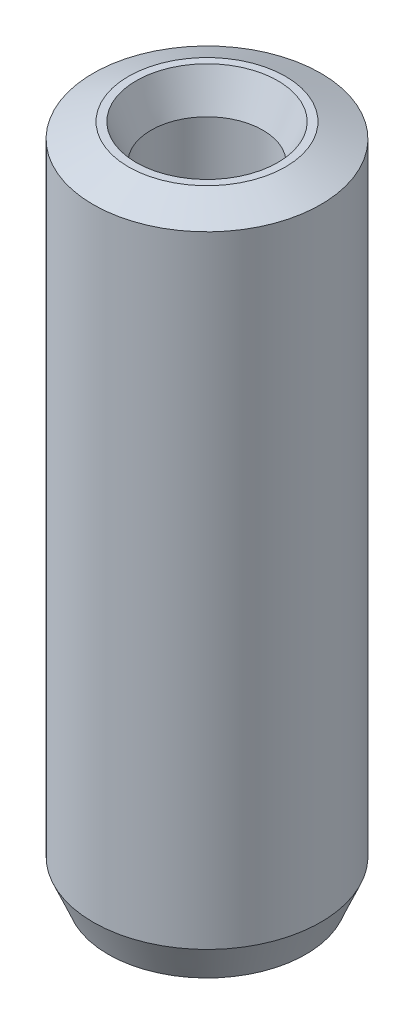
ISO-10303-21;
HEADER;
FILE_DESCRIPTION(('STEP AP214'),'2;1');
FILE_NAME('part.step','',(''),(''),'','','');
FILE_SCHEMA(('AUTOMOTIVE_DESIGN { 1 0 10303 214 1 1 1 1 }'));
ENDSEC;
DATA;
#1=APPLICATION_CONTEXT('core data for automotive mechanical design processes');
#2=APPLICATION_PROTOCOL_DEFINITION('international standard','automotive_design',2000,#1);
#3=PRODUCT_CONTEXT('',#1,'mechanical');
#4=PRODUCT('Part','Part','',(#3));
#5=PRODUCT_RELATED_PRODUCT_CATEGORY('part','',(#4));
#6=PRODUCT_DEFINITION_FORMATION('','',#4);
#7=PRODUCT_DEFINITION_CONTEXT('part definition',#1,'design');
#8=PRODUCT_DEFINITION('design','',#6,#7);
#9=PRODUCT_DEFINITION_SHAPE('','',#8);
#10=(LENGTH_UNIT() NAMED_UNIT(*) SI_UNIT(.MILLI.,.METRE.));
#11=(NAMED_UNIT(*) PLANE_ANGLE_UNIT() SI_UNIT($,.RADIAN.));
#12=(NAMED_UNIT(*) SI_UNIT($,.STERADIAN.) SOLID_ANGLE_UNIT());
#13=UNCERTAINTY_MEASURE_WITH_UNIT(LENGTH_MEASURE(1.E-05),#10,'distance_accuracy_value','');
#14=(GEOMETRIC_REPRESENTATION_CONTEXT(3) GLOBAL_UNCERTAINTY_ASSIGNED_CONTEXT((#13)) GLOBAL_UNIT_ASSIGNED_CONTEXT((#10,
#11,#12)) REPRESENTATION_CONTEXT('',''));
#15=CARTESIAN_POINT('',(0.,0.,0.));
#16=DIRECTION('',(0.,0.,1.));
#17=DIRECTION('',(1.,0.,0.));
#18=AXIS2_PLACEMENT_3D('',#15,#16,#17);
#19=CARTESIAN_POINT('',(0.,29.5099725010474,0.));
#20=DIRECTION('',(0.,-1.,0.));
#21=DIRECTION('',(0.,0.,-1.));
#22=AXIS2_PLACEMENT_3D('',#19,#20,#21);
#23=CYLINDRICAL_SURFACE('',#22,5.);
#24=CARTESIAN_POINT('',(0.,1.55133346219069,0.));
#25=DIRECTION('',(0.,1.,0.));
#26=DIRECTION('',(0.,0.,1.));
#27=AXIS2_PLACEMENT_3D('',#24,#25,#26);
#28=CIRCLE('',#27,5.);
#29=CARTESIAN_POINT('',(0.,1.55133346219069,-5.));
#30=VERTEX_POINT('',#29);
#31=EDGE_CURVE('E10',#30,#30,#28,.T.);
#32=CARTESIAN_POINT('',(0.,28.8526607672738,0.));
#33=DIRECTION('',(0.,1.,0.));
#34=DIRECTION('',(0.,0.,1.));
#35=AXIS2_PLACEMENT_3D('',#32,#33,#34);
#36=CIRCLE('',#35,5.);
#37=CARTESIAN_POINT('',(0.,28.8526607672738,-5.));
#38=VERTEX_POINT('',#37);
#39=EDGE_CURVE('E50',#38,#38,#36,.F.);
#40=CARTESIAN_POINT('',(0.,1.55133346219069,-5.));
#41=CARTESIAN_POINT('',(0.,1.8357222882853,-5.));
#42=CARTESIAN_POINT('',(0.,2.12011111437992,-5.));
#43=CARTESIAN_POINT('',(0.,2.68888876656915,-5.));
#44=CARTESIAN_POINT('',(0.,2.97327759266377,-5.));
#45=CARTESIAN_POINT('',(0.,3.542055244853,-5.));
#46=CARTESIAN_POINT('',(0.,3.82644407094761,-5.));
#47=CARTESIAN_POINT('',(0.,4.39522172313684,-5.));
#48=CARTESIAN_POINT('',(0.,4.67961054923146,-5.));
#49=CARTESIAN_POINT('',(0.,5.24838820142069,-5.));
#50=CARTESIAN_POINT('',(0.,5.53277702751531,-5.));
#51=CARTESIAN_POINT('',(0.,6.10155467970454,-5.));
#52=CARTESIAN_POINT('',(0.,6.38594350579915,-5.));
#53=CARTESIAN_POINT('',(0.,6.95472115798838,-5.));
#54=CARTESIAN_POINT('',(0.,7.239109984083,-5.));
#55=CARTESIAN_POINT('',(0.,7.80788763627223,-5.));
#56=CARTESIAN_POINT('',(0.,8.09227646236685,-5.));
#57=CARTESIAN_POINT('',(0.,8.66105411455608,-5.));
#58=CARTESIAN_POINT('',(0.,8.94544294065069,-5.));
#59=CARTESIAN_POINT('',(0.,9.51422059283992,-5.));
#60=CARTESIAN_POINT('',(0.,9.79860941893454,-5.));
#61=CARTESIAN_POINT('',(0.,10.3673870711238,-5.));
#62=CARTESIAN_POINT('',(0.,10.6517758972184,-5.));
#63=CARTESIAN_POINT('',(0.,11.2205535494076,-5.));
#64=CARTESIAN_POINT('',(0.,11.5049423755022,-5.));
#65=CARTESIAN_POINT('',(0.,12.0737200276915,-5.));
#66=CARTESIAN_POINT('',(0.,12.3581088537861,-5.));
#67=CARTESIAN_POINT('',(0.,12.9268865059753,-5.));
#68=CARTESIAN_POINT('',(0.,13.2112753320699,-5.));
#69=CARTESIAN_POINT('',(0.,13.7800529842592,-5.));
#70=CARTESIAN_POINT('',(0.,14.0644418103538,-5.));
#71=CARTESIAN_POINT('',(0.,14.633219462543,-5.));
#72=CARTESIAN_POINT('',(0.,14.9176082886376,-5.));
#73=CARTESIAN_POINT('',(0.,15.4863859408269,-5.));
#74=CARTESIAN_POINT('',(0.,15.7707747669215,-5.));
#75=CARTESIAN_POINT('',(0.,16.3395524191107,-5.));
#76=CARTESIAN_POINT('',(0.,16.6239412452053,-5.));
#77=CARTESIAN_POINT('',(0.,17.1927188973945,-5.));
#78=CARTESIAN_POINT('',(0.,17.4771077234892,-5.));
#79=CARTESIAN_POINT('',(0.,18.0458853756784,-5.));
#80=CARTESIAN_POINT('',(0.,18.330274201773,-5.));
#81=CARTESIAN_POINT('',(0.,18.8990518539622,-5.));
#82=CARTESIAN_POINT('',(0.,19.1834406800569,-5.));
#83=CARTESIAN_POINT('',(0.,19.7522183322461,-5.));
#84=CARTESIAN_POINT('',(0.,20.0366071583407,-5.));
#85=CARTESIAN_POINT('',(0.,20.6053848105299,-5.));
#86=CARTESIAN_POINT('',(0.,20.8897736366246,-5.));
#87=CARTESIAN_POINT('',(0.,21.4585512888138,-5.));
#88=CARTESIAN_POINT('',(0.,21.7429401149084,-5.));
#89=CARTESIAN_POINT('',(0.,22.3117177670976,-5.));
#90=CARTESIAN_POINT('',(0.,22.5961065931922,-5.));
#91=CARTESIAN_POINT('',(0.,23.1648842453815,-5.));
#92=CARTESIAN_POINT('',(0.,23.4492730714761,-5.));
#93=CARTESIAN_POINT('',(0.,24.0180507236653,-5.));
#94=CARTESIAN_POINT('',(0.,24.3024395497599,-5.));
#95=CARTESIAN_POINT('',(0.,24.8712172019492,-5.));
#96=CARTESIAN_POINT('',(0.,25.1556060280438,-5.));
#97=CARTESIAN_POINT('',(0.,25.724383680233,-5.));
#98=CARTESIAN_POINT('',(0.,26.0087725063276,-5.));
#99=CARTESIAN_POINT('',(0.,26.5775501585169,-5.));
#100=CARTESIAN_POINT('',(0.,26.8619389846115,-5.));
#101=CARTESIAN_POINT('',(0.,27.4307166368007,-5.));
#102=CARTESIAN_POINT('',(0.,27.7151054628953,-5.));
#103=CARTESIAN_POINT('',(0.,28.2838831150846,-5.));
#104=CARTESIAN_POINT('',(0.,28.5682719411792,-5.));
#105=CARTESIAN_POINT('',(0.,28.8526607672738,-5.));
#106=B_SPLINE_CURVE_WITH_KNOTS('',3,(#40,#41,#42,#43,#44,#45,#46,#47,#48,#49,#50,#51,#52,#53,
#54,#55,#56,#57,#58,#59,#60,#61,#62,#63,#64,#65,#66,#67,#68,#69,#70,#71,#72,#73,#74,#75,#76,#77,
#78,#79,#80,#81,#82,#83,#84,#85,#86,#87,#88,#89,#90,#91,#92,#93,#94,#95,#96,#97,#98,#99,#100,
#101,#102,#103,#104,#105),.UNSPECIFIED.,.F.,.F.,(4,2,2,2,2,2,2,2,2,2,2,2,2,2,2,2,2,2,2,2,2,2,2,
2,2,2,2,2,2,2,2,2,4),(0.,0.853166478283846,1.70633295656769,2.55949943485154,3.41266591313539,
4.26583239141923,5.11899886970308,5.97216534798693,6.82533182627077,7.67849830455462,
8.53166478283847,9.38483126112232,10.2379977394062,11.09116421769,11.9443306959739,
12.7974971742577,13.6506636525415,14.5038301308254,15.3569966091092,16.2101630873931,
17.0633295656769,17.9164960439608,18.7696625222446,19.6228290005285,20.4759954788123,
21.3291619570962,22.18232843538,23.0354949136639,23.8886613919477,24.7418278702316,
25.5949943485154,26.4481608267992,27.3013273050831),.UNSPECIFIED.);
#107=EDGE_CURVE('BSEAM39',#30,#38,#106,.T.);
#108=ORIENTED_EDGE('',*,*,#31,.T.);
#109=ORIENTED_EDGE('',*,*,#39,.T.);
#110=ORIENTED_EDGE('',*,*,#107,.T.);
#111=ORIENTED_EDGE('',*,*,#107,.F.);
#112=EDGE_LOOP('',(#108,#110,#109,#111));
#113=FACE_BOUND('',#112,.T.);
#114=ADVANCED_FACE('F39',(#113),#23,.T.);
#115=CARTESIAN_POINT('',(0.,29.5099725010474,0.));
#116=DIRECTION('',(0.,1.,0.));
#117=DIRECTION('',(0.,0.,1.));
#118=AXIS2_PLACEMENT_3D('',#115,#116,#117);
#119=PLANE('',#118);
#120=CARTESIAN_POINT('',(0.,29.5099725010474,0.));
#121=DIRECTION('',(0.,1.,0.));
#122=DIRECTION('',(0.,0.,1.));
#123=AXIS2_PLACEMENT_3D('',#120,#121,#122);
#124=CIRCLE('',#123,3.11304824204588);
#125=CARTESIAN_POINT('',(0.,29.5099725010474,3.11304824204588));
#126=VERTEX_POINT('',#125);
#127=EDGE_CURVE('E58',#126,#126,#124,.F.);
#128=ORIENTED_EDGE('',*,*,#127,.T.);
#129=EDGE_LOOP('',(#128));
#130=FACE_BOUND('',#129,.T.);
#131=CARTESIAN_POINT('',(0.,29.5099725010474,0.));
#132=DIRECTION('',(0.,1.,0.));
#133=DIRECTION('',(0.,0.,1.));
#134=AXIS2_PLACEMENT_3D('',#131,#132,#133);
#135=CIRCLE('',#134,3.44866653780942);
#136=CARTESIAN_POINT('',(0.,29.5099725010474,3.44866653780942));
#137=VERTEX_POINT('',#136);
#138=EDGE_CURVE('E61',#137,#137,#135,.T.);
#139=ORIENTED_EDGE('',*,*,#138,.T.);
#140=EDGE_LOOP('',(#139));
#141=FACE_BOUND('',#140,.T.);
#142=ADVANCED_FACE('F88',(#130,#141),#119,.T.);
#143=CARTESIAN_POINT('',(0.,0.,0.));
#144=DIRECTION('',(0.,1.,0.));
#145=DIRECTION('',(0.,0.,1.));
#146=AXIS2_PLACEMENT_3D('',#143,#144,#145);
#147=PLANE('',#146);
#148=CARTESIAN_POINT('',(0.,0.,0.));
#149=DIRECTION('',(0.,1.,0.));
#150=DIRECTION('',(0.,0.,1.));
#151=AXIS2_PLACEMENT_3D('',#148,#149,#150);
#152=CIRCLE('',#151,4.00706997046281);
#153=CARTESIAN_POINT('',(0.,0.,4.00706997046281));
#154=VERTEX_POINT('',#153);
#155=EDGE_CURVE('E51',#154,#154,#152,.T.);
#156=ORIENTED_EDGE('',*,*,#155,.T.);
#157=EDGE_LOOP('',(#156));
#158=FACE_BOUND('',#157,.T.);
#159=CARTESIAN_POINT('',(0.,0.,0.));
#160=DIRECTION('',(0.,1.,0.));
#161=DIRECTION('',(0.,0.,1.));
#162=AXIS2_PLACEMENT_3D('',#159,#160,#161);
#163=CIRCLE('',#162,4.34268826622634);
#164=CARTESIAN_POINT('',(0.,0.,4.34268826622634));
#165=VERTEX_POINT('',#164);
#166=EDGE_CURVE('E54',#165,#165,#163,.F.);
#167=ORIENTED_EDGE('',*,*,#166,.T.);
#168=EDGE_LOOP('',(#167));
#169=FACE_BOUND('',#168,.T.);
#170=ADVANCED_FACE('F83',(#158,#169),#147,.F.);
#171=CARTESIAN_POINT('',(0.,29.5099725010474,0.));
#172=DIRECTION('',(0.,-1.,0.));
#173=DIRECTION('',(0.,0.,-1.));
#174=AXIS2_PLACEMENT_3D('',#171,#172,#173);
#175=CYLINDRICAL_SURFACE('',#174,2.45573650827224);
#176=CARTESIAN_POINT('',(0.,27.9586390388567,0.));
#177=DIRECTION('',(0.,1.,0.));
#178=DIRECTION('',(0.,0.,1.));
#179=AXIS2_PLACEMENT_3D('',#176,#177,#178);
#180=CIRCLE('',#179,2.45573650827224);
#181=CARTESIAN_POINT('',(0.,27.9586390388567,-2.45573650827224));
#182=VERTEX_POINT('',#181);
#183=EDGE_CURVE('E67',#182,#182,#180,.T.);
#184=CARTESIAN_POINT('',(0.,0.657311733773609,0.));
#185=DIRECTION('',(0.,1.,0.));
#186=DIRECTION('',(0.,0.,1.));
#187=AXIS2_PLACEMENT_3D('',#184,#185,#186);
#188=CIRCLE('',#187,2.45573650827224);
#189=CARTESIAN_POINT('',(0.,0.657311733773609,-2.45573650827224));
#190=VERTEX_POINT('',#189);
#191=EDGE_CURVE('E69',#190,#190,#188,.F.);
#192=CARTESIAN_POINT('',(0.,27.9586390388567,-2.45573650827224));
#193=CARTESIAN_POINT('',(0.,27.6742502127621,-2.45573650827224));
#194=CARTESIAN_POINT('',(0.,27.3898613866675,-2.45573650827224));
#195=CARTESIAN_POINT('',(0.,26.8210837344783,-2.45573650827224));
#196=CARTESIAN_POINT('',(0.,26.5366949083837,-2.45573650827224));
#197=CARTESIAN_POINT('',(0.,25.9679172561944,-2.45573650827224));
#198=CARTESIAN_POINT('',(0.,25.6835284300998,-2.45573650827224));
#199=CARTESIAN_POINT('',(0.,25.1147507779106,-2.45573650827224));
#200=CARTESIAN_POINT('',(0.,24.830361951816,-2.45573650827224));
#201=CARTESIAN_POINT('',(0.,24.2615842996267,-2.45573650827224));
#202=CARTESIAN_POINT('',(0.,23.9771954735321,-2.45573650827224));
#203=CARTESIAN_POINT('',(0.,23.4084178213429,-2.45573650827224));
#204=CARTESIAN_POINT('',(0.,23.1240289952483,-2.45573650827224));
#205=CARTESIAN_POINT('',(0.,22.555251343059,-2.45573650827224));
#206=CARTESIAN_POINT('',(0.,22.2708625169644,-2.45573650827224));
#207=CARTESIAN_POINT('',(0.,21.7020848647752,-2.45573650827224));
#208=CARTESIAN_POINT('',(0.,21.4176960386806,-2.45573650827224));
#209=CARTESIAN_POINT('',(0.,20.8489183864913,-2.45573650827224));
#210=CARTESIAN_POINT('',(0.,20.5645295603967,-2.45573650827224));
#211=CARTESIAN_POINT('',(0.,19.9957519082075,-2.45573650827224));
#212=CARTESIAN_POINT('',(0.,19.7113630821129,-2.45573650827224));
#213=CARTESIAN_POINT('',(0.,19.1425854299237,-2.45573650827224));
#214=CARTESIAN_POINT('',(0.,18.858196603829,-2.45573650827224));
#215=CARTESIAN_POINT('',(0.,18.2894189516398,-2.45573650827224));
#216=CARTESIAN_POINT('',(0.,18.0050301255452,-2.45573650827224));
#217=CARTESIAN_POINT('',(0.,17.436252473356,-2.45573650827224));
#218=CARTESIAN_POINT('',(0.,17.1518636472613,-2.45573650827224));
#219=CARTESIAN_POINT('',(0.,16.5830859950721,-2.45573650827224));
#220=CARTESIAN_POINT('',(0.,16.2986971689775,-2.45573650827224));
#221=CARTESIAN_POINT('',(0.,15.7299195167883,-2.45573650827224));
#222=CARTESIAN_POINT('',(0.,15.4455306906936,-2.45573650827224));
#223=CARTESIAN_POINT('',(0.,14.8767530385044,-2.45573650827224));
#224=CARTESIAN_POINT('',(0.,14.5923642124098,-2.45573650827224));
#225=CARTESIAN_POINT('',(0.,14.0235865602206,-2.45573650827224));
#226=CARTESIAN_POINT('',(0.,13.7391977341259,-2.45573650827224));
#227=CARTESIAN_POINT('',(0.,13.1704200819367,-2.45573650827224));
#228=CARTESIAN_POINT('',(0.,12.8860312558421,-2.45573650827224));
#229=CARTESIAN_POINT('',(0.,12.3172536036529,-2.45573650827224));
#230=CARTESIAN_POINT('',(0.,12.0328647775583,-2.45573650827224));
#231=CARTESIAN_POINT('',(0.,11.464087125369,-2.45573650827224));
#232=CARTESIAN_POINT('',(0.,11.1796982992744,-2.45573650827224));
#233=CARTESIAN_POINT('',(0.,10.6109206470852,-2.45573650827224));
#234=CARTESIAN_POINT('',(0.,10.3265318209906,-2.45573650827224));
#235=CARTESIAN_POINT('',(0.,9.75775416880132,-2.45573650827224));
#236=CARTESIAN_POINT('',(0.,9.47336534270671,-2.45573650827224));
#237=CARTESIAN_POINT('',(0.,8.90458769051748,-2.45573650827224));
#238=CARTESIAN_POINT('',(0.,8.62019886442286,-2.45573650827224));
#239=CARTESIAN_POINT('',(0.,8.05142121223363,-2.45573650827224));
#240=CARTESIAN_POINT('',(0.,7.76703238613901,-2.45573650827224));
#241=CARTESIAN_POINT('',(0.,7.19825473394978,-2.45573650827224));
#242=CARTESIAN_POINT('',(0.,6.91386590785516,-2.45573650827224));
#243=CARTESIAN_POINT('',(0.,6.34508825566593,-2.45573650827224));
#244=CARTESIAN_POINT('',(0.,6.06069942957131,-2.45573650827224));
#245=CARTESIAN_POINT('',(0.,5.49192177738208,-2.45573650827224));
#246=CARTESIAN_POINT('',(0.,5.20753295128747,-2.45573650827224));
#247=CARTESIAN_POINT('',(0.,4.63875529909823,-2.45573650827224));
#248=CARTESIAN_POINT('',(0.,4.35436647300362,-2.45573650827224));
#249=CARTESIAN_POINT('',(0.,3.78558882081439,-2.45573650827224));
#250=CARTESIAN_POINT('',(0.,3.50119999471977,-2.45573650827224));
#251=CARTESIAN_POINT('',(0.,2.93242234253054,-2.45573650827224));
#252=CARTESIAN_POINT('',(0.,2.64803351643592,-2.45573650827224));
#253=CARTESIAN_POINT('',(0.,2.07925586424669,-2.45573650827224));
#254=CARTESIAN_POINT('',(0.,1.79486703815208,-2.45573650827224));
#255=CARTESIAN_POINT('',(0.,1.22608938596284,-2.45573650827224));
#256=CARTESIAN_POINT('',(0.,0.941700559868226,-2.45573650827224));
#257=CARTESIAN_POINT('',(0.,0.657311733773609,-2.45573650827224));
#258=B_SPLINE_CURVE_WITH_KNOTS('',3,(#192,#193,#194,#195,#196,#197,#198,#199,#200,#201,#202,
#203,#204,#205,#206,#207,#208,#209,#210,#211,#212,#213,#214,#215,#216,#217,#218,#219,#220,#221,
#222,#223,#224,#225,#226,#227,#228,#229,#230,#231,#232,#233,#234,#235,#236,#237,#238,#239,#240,
#241,#242,#243,#244,#245,#246,#247,#248,#249,#250,#251,#252,#253,#254,#255,#256,#257),
.UNSPECIFIED.,.F.,.F.,(4,2,2,2,2,2,2,2,2,2,2,2,2,2,2,2,2,2,2,2,2,2,2,2,2,2,2,2,2,2,2,2,4),(0.,
0.853166478283849,1.7063329565677,2.55949943485155,3.41266591313539,4.26583239141924,
5.11899886970309,5.97216534798694,6.82533182627078,7.67849830455463,8.53166478283848,
9.38483126112233,10.2379977394062,11.09116421769,11.9443306959739,12.7974971742577,
13.6506636525416,14.5038301308254,15.3569966091093,16.2101630873931,17.063329565677,
17.9164960439608,18.7696625222447,19.6228290005285,20.4759954788124,21.3291619570962,
22.1823284353801,23.0354949136639,23.8886613919477,24.7418278702316,25.5949943485154,
26.4481608267993,27.3013273050831),.UNSPECIFIED.);
#259=EDGE_CURVE('BSEAM71',#182,#190,#258,.T.);
#260=ORIENTED_EDGE('',*,*,#183,.T.);
#261=ORIENTED_EDGE('',*,*,#191,.T.);
#262=ORIENTED_EDGE('',*,*,#259,.T.);
#263=ORIENTED_EDGE('',*,*,#259,.F.);
#264=EDGE_LOOP('',(#260,#262,#261,#263));
#265=FACE_BOUND('',#264,.T.);
#266=ADVANCED_FACE('F71',(#265),#175,.F.);
#267=CARTESIAN_POINT('',(0.,27.9586390388567,0.));
#268=DIRECTION('',(0.,1.,0.));
#269=DIRECTION('',(0.,0.,1.));
#270=AXIS2_PLACEMENT_3D('',#267,#268,#269);
#271=CONICAL_SURFACE('',#270,2.45573650827224,0.400775439722964);
#272=ORIENTED_EDGE('',*,*,#127,.F.);
#273=EDGE_LOOP('',(#272));
#274=FACE_BOUND('',#273,.T.);
#275=ORIENTED_EDGE('',*,*,#183,.F.);
#276=EDGE_LOOP('',(#275));
#277=FACE_BOUND('',#276,.T.);
#278=ADVANCED_FACE('F77',(#274,#277),#271,.F.);
#279=CARTESIAN_POINT('',(0.,0.,0.));
#280=DIRECTION('',(0.,-1.,0.));
#281=DIRECTION('',(0.,0.,-1.));
#282=AXIS2_PLACEMENT_3D('',#279,#280,#281);
#283=CONICAL_SURFACE('',#282,4.00706997046281,1.17002088707193);
#284=ORIENTED_EDGE('',*,*,#191,.F.);
#285=EDGE_LOOP('',(#284));
#286=FACE_BOUND('',#285,.T.);
#287=ORIENTED_EDGE('',*,*,#155,.F.);
#288=EDGE_LOOP('',(#287));
#289=FACE_BOUND('',#288,.T.);
#290=ADVANCED_FACE('F73',(#286,#289),#283,.F.);
#291=CARTESIAN_POINT('',(0.,1.55133346219069,0.));
#292=DIRECTION('',(0.,1.,0.));
#293=DIRECTION('',(0.,0.,1.));
#294=AXIS2_PLACEMENT_3D('',#291,#292,#293);
#295=CONICAL_SURFACE('',#294,5.,0.400775439722963);
#296=ORIENTED_EDGE('',*,*,#166,.F.);
#297=EDGE_LOOP('',(#296));
#298=FACE_BOUND('',#297,.T.);
#299=ORIENTED_EDGE('',*,*,#31,.F.);
#300=EDGE_LOOP('',(#299));
#301=FACE_BOUND('',#300,.T.);
#302=ADVANCED_FACE('F76',(#298,#301),#295,.T.);
#303=CARTESIAN_POINT('',(0.,29.5099725010474,0.));
#304=DIRECTION('',(0.,-1.,0.));
#305=DIRECTION('',(0.,0.,-1.));
#306=AXIS2_PLACEMENT_3D('',#303,#304,#305);
#307=CONICAL_SURFACE('',#306,3.44866653780942,1.17002088707193);
#308=ORIENTED_EDGE('',*,*,#39,.F.);
#309=EDGE_LOOP('',(#308));
#310=FACE_BOUND('',#309,.T.);
#311=ORIENTED_EDGE('',*,*,#138,.F.);
#312=EDGE_LOOP('',(#311));
#313=FACE_BOUND('',#312,.T.);
#314=ADVANCED_FACE('F45',(#310,#313),#307,.T.);
#315=CLOSED_SHELL('',(#114,#142,#170,#266,#278,#290,#302,#314));
#316=MANIFOLD_SOLID_BREP('B2',#315);
#317=ADVANCED_BREP_SHAPE_REPRESENTATION('',(#18,#316),#14);
#318=SHAPE_DEFINITION_REPRESENTATION(#9,#317);
ENDSEC;
END-ISO-10303-21;
